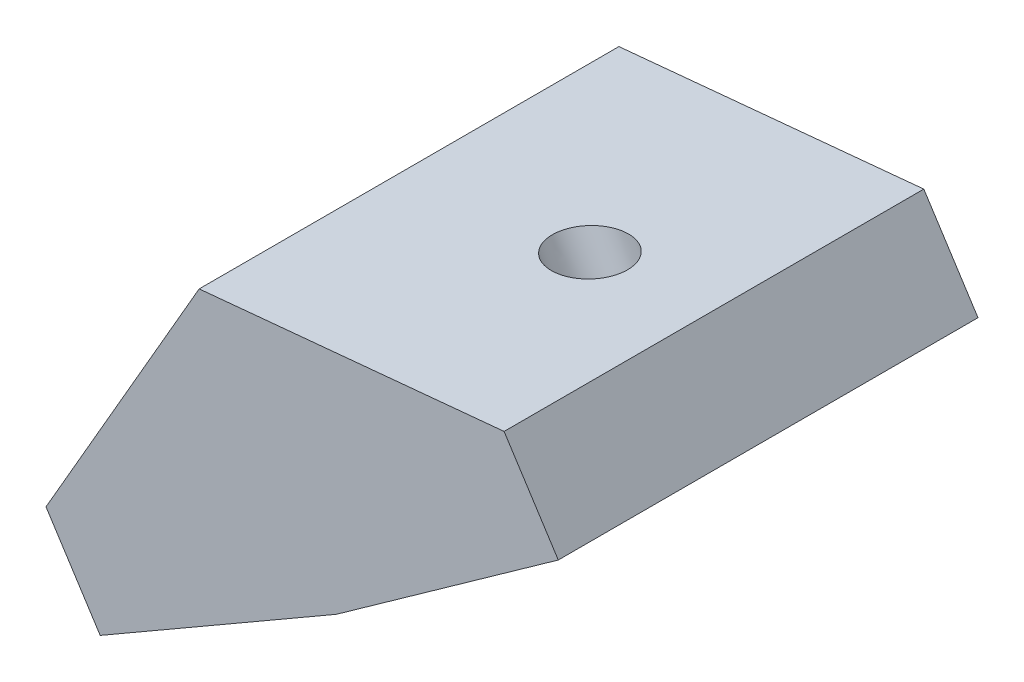
ISO-10303-21;
HEADER;
FILE_DESCRIPTION(('STEP AP214'),'2;1');
FILE_NAME('part.step','',(''),(''),'','','');
FILE_SCHEMA(('AUTOMOTIVE_DESIGN { 1 0 10303 214 1 1 1 1 }'));
ENDSEC;
DATA;
#1=APPLICATION_CONTEXT('core data for automotive mechanical design processes');
#2=APPLICATION_PROTOCOL_DEFINITION('international standard','automotive_design',2000,#1);
#3=PRODUCT_CONTEXT('',#1,'mechanical');
#4=PRODUCT('Part','Part','',(#3));
#5=PRODUCT_RELATED_PRODUCT_CATEGORY('part','',(#4));
#6=PRODUCT_DEFINITION_FORMATION('','',#4);
#7=PRODUCT_DEFINITION_CONTEXT('part definition',#1,'design');
#8=PRODUCT_DEFINITION('design','',#6,#7);
#9=PRODUCT_DEFINITION_SHAPE('','',#8);
#10=(LENGTH_UNIT() NAMED_UNIT(*) SI_UNIT(.MILLI.,.METRE.));
#11=(NAMED_UNIT(*) PLANE_ANGLE_UNIT() SI_UNIT($,.RADIAN.));
#12=(NAMED_UNIT(*) SI_UNIT($,.STERADIAN.) SOLID_ANGLE_UNIT());
#13=UNCERTAINTY_MEASURE_WITH_UNIT(LENGTH_MEASURE(1.E-05),#10,'distance_accuracy_value','');
#14=(GEOMETRIC_REPRESENTATION_CONTEXT(3) GLOBAL_UNCERTAINTY_ASSIGNED_CONTEXT((#13)) GLOBAL_UNIT_ASSIGNED_CONTEXT((#10,
#11,#12)) REPRESENTATION_CONTEXT('',''));
#15=CARTESIAN_POINT('',(0.,0.,0.));
#16=DIRECTION('',(0.,0.,1.));
#17=DIRECTION('',(1.,0.,0.));
#18=AXIS2_PLACEMENT_3D('',#15,#16,#17);
#19=CARTESIAN_POINT('',(1.98354597778799,3.18342045954603,7.5));
#20=DIRECTION('',(-0.5,0.866025403784439,0.));
#21=DIRECTION('',(-0.866025403784439,-0.5,0.));
#22=AXIS2_PLACEMENT_3D('',#19,#20,#21);
#23=PLANE('',#22);
#24=DIRECTION('',(0.866025403784439,0.5,0.));
#25=VECTOR('',#24,1.);
#26=CARTESIAN_POINT('',(1.98354597778799,3.18342045954603,-7.5));
#27=LINE('',#26,#25);
#28=CARTESIAN_POINT('',(1.98354597778799,3.18342045954603,-7.5));
#29=VERTEX_POINT('',#28);
#30=CARTESIAN_POINT('',(10.4192557731961,8.05377978073045,-7.5));
#31=VERTEX_POINT('',#30);
#32=EDGE_CURVE('E153',#29,#31,#27,.T.);
#33=ORIENTED_EDGE('',*,*,#32,.T.);
#34=DIRECTION('',(0.,0.,-1.));
#35=VECTOR('',#34,1.);
#36=CARTESIAN_POINT('',(10.4192557731961,8.05377978073045,7.5));
#37=LINE('',#36,#35);
#38=CARTESIAN_POINT('',(10.4192557731961,8.05377978073046,7.5));
#39=VERTEX_POINT('',#38);
#40=EDGE_CURVE('E123',#39,#31,#37,.T.);
#41=ORIENTED_EDGE('',*,*,#40,.F.);
#42=DIRECTION('',(0.866025403784439,0.5,0.));
#43=VECTOR('',#42,1.);
#44=CARTESIAN_POINT('',(1.98354597778799,3.18342045954603,7.5));
#45=LINE('',#44,#43);
#46=CARTESIAN_POINT('',(1.98354597778799,3.18342045954603,7.5));
#47=VERTEX_POINT('',#46);
#48=EDGE_CURVE('E86',#47,#39,#45,.T.);
#49=ORIENTED_EDGE('',*,*,#48,.F.);
#50=DIRECTION('',(0.,0.,-1.));
#51=VECTOR('',#50,1.);
#52=CARTESIAN_POINT('',(1.98354597778799,3.18342045954603,7.5));
#53=LINE('',#52,#51);
#54=EDGE_CURVE('E11',#47,#29,#53,.T.);
#55=ORIENTED_EDGE('',*,*,#54,.T.);
#56=EDGE_LOOP('',(#33,#41,#49,#55));
#57=FACE_BOUND('',#56,.T.);
#58=CARTESIAN_POINT('',(6.8662474309727,6.0024494579148,0.));
#59=CARTESIAN_POINT('',(6.86624450170067,6.0024477666988,0.0692360372808675));
#60=CARTESIAN_POINT('',(6.86124738041633,5.99956267738011,0.138544759383818));
#61=CARTESIAN_POINT('',(6.84138977339541,5.98809788262112,0.275212471246358));
#62=CARTESIAN_POINT('',(6.82652928765163,5.97951817717667,0.342571461004522));
#63=CARTESIAN_POINT('',(6.78735825768453,5.95690277248074,0.473531004420582));
#64=CARTESIAN_POINT('',(6.76304771528751,5.94286707428367,0.537131558804822));
#65=CARTESIAN_POINT('',(6.70564617673228,5.9097262805469,0.658806862274286));
#66=CARTESIAN_POINT('',(6.67255518338912,5.89062118663247,0.716881613131101));
#67=CARTESIAN_POINT('',(6.59850569104199,5.84786869229251,0.825907059313234));
#68=CARTESIAN_POINT('',(6.55754719495367,5.82422129355034,0.876857757278686));
#69=CARTESIAN_POINT('',(6.46889232818168,5.77303638235455,0.970228867189419));
#70=CARTESIAN_POINT('',(6.42119596005827,5.74549887137912,1.01264928237605));
#71=CARTESIAN_POINT('',(6.32038090105841,5.68729326992718,1.08779007522111));
#72=CARTESIAN_POINT('',(6.26726221206751,5.65662518053929,1.1205104562526));
#73=CARTESIAN_POINT('',(6.1570675922227,5.59300428710865,1.1753486492635));
#74=CARTESIAN_POINT('',(6.09999166246649,5.56005148369965,1.19746646418396));
#75=CARTESIAN_POINT('',(5.98345679052688,5.49277004401534,1.23048951180262));
#76=CARTESIAN_POINT('',(5.92399784876444,5.45844140798305,1.24139474648157));
#77=CARTESIAN_POINT('',(5.80433690463181,5.38935512967659,1.25169185277391));
#78=CARTESIAN_POINT('',(5.74413490230365,5.35459748742666,1.2510837250385));
#79=CARTESIAN_POINT('',(5.62464828690112,5.28561185785946,1.2383708824736));
#80=CARTESIAN_POINT('',(5.56536367382643,5.251383870542,1.22626616764803));
#81=CARTESIAN_POINT('',(5.44934698670544,5.18440160500221,1.19089401654125));
#82=CARTESIAN_POINT('',(5.39261491265609,5.15164732677813,1.1676265802733));
#83=CARTESIAN_POINT('',(5.28326804968944,5.08851588600928,1.11057073629286));
#84=CARTESIAN_POINT('',(5.23065326076428,5.05813872345997,1.07678232860041));
#85=CARTESIAN_POINT('',(5.13099215221383,5.00059935561063,0.9996164743412));
#86=CARTESIAN_POINT('',(5.0839458325751,4.97343715030284,0.956239027797567));
#87=CARTESIAN_POINT('',(4.99671925925276,4.92307686471471,0.861091506091968));
#88=CARTESIAN_POINT('',(4.95653900555091,4.89987878442385,0.809321430952286));
#89=CARTESIAN_POINT('',(4.88415278426738,4.85808658008017,0.698816540403866));
#90=CARTESIAN_POINT('',(4.85194681666491,4.83949245601536,0.640081725013289));
#91=CARTESIAN_POINT('',(4.7963974458961,4.80742101184867,0.517267336754032));
#92=CARTESIAN_POINT('',(4.77305404270962,4.79394369173516,0.453187763897507));
#93=CARTESIAN_POINT('',(4.73587363833596,4.77247757526146,0.321451256574587));
#94=CARTESIAN_POINT('',(4.72203663713271,4.76448877889198,0.253794322114244));
#95=CARTESIAN_POINT('',(4.70425067656512,4.75422004977049,0.116769153873382));
#96=CARTESIAN_POINT('',(4.70030171719166,4.7519401170132,0.0474009200944441));
#97=CARTESIAN_POINT('',(4.70240075690233,4.75315199815519,-0.0911335856281336));
#98=CARTESIAN_POINT('',(4.70844875598592,4.75664381205416,-0.160299857571784));
#99=CARTESIAN_POINT('',(4.73037490213922,4.76930287843806,-0.296522748723949));
#100=CARTESIAN_POINT('',(4.74625304921701,4.77847013092765,-0.363579367930733));
#101=CARTESIAN_POINT('',(4.78740155435995,4.80222723144869,-0.493733448479131));
#102=CARTESIAN_POINT('',(4.81267191244018,4.81681707948884,-0.556830909814389));
#103=CARTESIAN_POINT('',(4.87190785423696,4.8510169664309,-0.677326366223164));
#104=CARTESIAN_POINT('',(4.90587343797276,4.87062700534394,-0.734724361284056));
#105=CARTESIAN_POINT('',(4.9815630202021,4.9143264060189,-0.84223777313564));
#106=CARTESIAN_POINT('',(5.02328701871567,4.93841576779238,-0.892353189907531));
#107=CARTESIAN_POINT('',(5.11334263160538,4.9904094001363,-0.983919194089535));
#108=CARTESIAN_POINT('',(5.16167424599913,5.01831367071691,-1.02536978147655));
#109=CARTESIAN_POINT('',(5.2636120435357,5.07716748556524,-1.09846286172483));
#110=CARTESIAN_POINT('',(5.31721822669149,5.10811702984046,-1.13010535456198));
#111=CARTESIAN_POINT('',(5.42822663324675,5.17220776324743,-1.18270950027551));
#112=CARTESIAN_POINT('',(5.48562885665374,5.20534895238353,-1.20367115313074));
#113=CARTESIAN_POINT('',(5.60264611371615,5.27290889724835,-1.2343354656682));
#114=CARTESIAN_POINT('',(5.66226114737442,5.30732765297873,-1.24403812533595));
#115=CARTESIAN_POINT('',(5.78205976147147,5.37649341507621,-1.25191683784366));
#116=CARTESIAN_POINT('',(5.84224334191051,5.41124042144347,-1.25009289067842));
#117=CARTESIAN_POINT('',(5.96151910480447,5.48010431525809,-1.23496869615716));
#118=CARTESIAN_POINT('',(6.02061128725987,5.51422120270572,-1.22166844880612));
#119=CARTESIAN_POINT('',(6.13607441110728,5.58088386834051,-1.1839584964282));
#120=CARTESIAN_POINT('',(6.19244535250276,5.61342964652967,-1.15954879141544));
#121=CARTESIAN_POINT('',(6.30091121209113,5.6760524397609,-1.10029317158898));
#122=CARTESIAN_POINT('',(6.35300613029244,5.70612945480783,-1.06544725679583));
#123=CARTESIAN_POINT('',(6.45148308602903,5.76298515171131,-0.986280345090121));
#124=CARTESIAN_POINT('',(6.4978651235783,5.78976383357594,-0.941959348200784));
#125=CARTESIAN_POINT('',(6.58363708886985,5.83928430082594,-0.845064603531294));
#126=CARTESIAN_POINT('',(6.62302701663075,5.86202608622207,-0.792490855773126));
#127=CARTESIAN_POINT('',(6.69372817044642,5.90284541640955,-0.680541049183821));
#128=CARTESIAN_POINT('',(6.72503939652207,5.92092296121298,-0.621164990370271));
#129=CARTESIAN_POINT('',(6.77872018148761,5.95191557686314,-0.497246792454204));
#130=CARTESIAN_POINT('',(6.80108974039739,5.96483064772136,-0.432704653363173));
#131=CARTESIAN_POINT('',(6.83424606031273,5.98397345794983,-0.307852941350757));
#132=CARTESIAN_POINT('',(6.84606865543584,5.99079923642669,-0.247909616095609));
#133=CARTESIAN_POINT('',(6.85807954031633,5.99773372404564,-0.156424213290056));
#134=CARTESIAN_POINT('',(6.86113002738977,5.99949492357865,-0.125353522952124));
#135=CARTESIAN_POINT('',(6.86522039572928,6.00185649884054,-0.0628608789359379));
#136=CARTESIAN_POINT('',(6.86624876106408,6.00245022584342,-0.031437932494741));
#137=CARTESIAN_POINT('',(6.8662474309727,6.0024494579148,0.));
#138=B_SPLINE_CURVE_WITH_KNOTS('',3,(#58,#59,#60,#61,#62,#63,#64,#65,#66,#67,#68,#69,#70,#71,
#72,#73,#74,#75,#76,#77,#78,#79,#80,#81,#82,#83,#84,#85,#86,#87,#88,#89,#90,#91,#92,#93,#94,#95,
#96,#97,#98,#99,#100,#101,#102,#103,#104,#105,#106,#107,#108,#109,#110,#111,#112,#113,#114,#115,
#116,#117,#118,#119,#120,#121,#122,#123,#124,#125,#126,#127,#128,#129,#130,#131,#132,#133,#134,
#135,#136,#137),.UNSPECIFIED.,.T.,.F.,(4,2,2,2,2,2,2,2,2,2,2,2,2,2,2,2,2,2,2,2,2,2,2,2,2,2,2,2,
2,2,2,2,2,2,2,2,2,2,2,4),(0.,0.207595574075841,0.415191148303471,0.622786682411624,
0.830382149963753,1.03797754058197,1.24557285231763,1.45316809186484,1.66076327382698,
1.8683584191167,2.07595355266464,2.28354868614155,2.49114381937174,2.69873895220653,
2.90633408454058,3.1139292163234,3.32152434756493,3.52911947833437,3.73671460875266,
3.94430973897923,4.15190486919449,4.35949999958012,4.56709513029909,4.7746902614779,
4.98228539319263,5.18988052546066,5.39747565823873,5.60507079142771,5.81266592488346,
6.02026105843259,6.2278561918915,6.43545132508646,6.64304645787265,6.85064159015006,
7.05823672187442,7.26583185306203,7.47342698378804,7.65715996579783,7.75089039943373,
7.84515309701597),.UNSPECIFIED.);
#139=CARTESIAN_POINT('',(6.8662474309727,6.0024494579148,0.));
#140=VERTEX_POINT('',#139);
#141=EDGE_CURVE('E162',#140,#140,#138,.T.);
#142=ORIENTED_EDGE('',*,*,#141,.F.);
#143=EDGE_LOOP('',(#142));
#144=FACE_BOUND('',#143,.T.);
#145=ADVANCED_FACE('F38',(#57,#144),#23,.F.);
#146=CARTESIAN_POINT('',(5.52101325506801,15.6773344329994,7.5));
#147=DIRECTION('',(0.866025403784439,-0.5,0.));
#148=DIRECTION('',(0.5,0.866025403784439,0.));
#149=AXIS2_PLACEMENT_3D('',#146,#147,#148);
#150=PLANE('',#149);
#151=DIRECTION('',(-0.5,-0.866025403784439,0.));
#152=VECTOR('',#151,1.);
#153=CARTESIAN_POINT('',(5.52101325506801,15.6773344329994,-7.5));
#154=LINE('',#153,#152);
#155=CARTESIAN_POINT('',(5.52101325506801,15.6773344329994,-7.5));
#156=VERTEX_POINT('',#155);
#157=CARTESIAN_POINT('',(0.0473877982673191,6.19673704021823,-7.5));
#158=VERTEX_POINT('',#157);
#159=EDGE_CURVE('E79',#156,#158,#154,.T.);
#160=ORIENTED_EDGE('',*,*,#159,.T.);
#161=DIRECTION('',(0.,0.,-1.));
#162=VECTOR('',#161,1.);
#163=CARTESIAN_POINT('',(0.0473877982673191,6.19673704021823,7.5));
#164=LINE('',#163,#162);
#165=CARTESIAN_POINT('',(0.0473877982673191,6.19673704021823,7.5));
#166=VERTEX_POINT('',#165);
#167=EDGE_CURVE('E53',#166,#158,#164,.T.);
#168=ORIENTED_EDGE('',*,*,#167,.F.);
#169=DIRECTION('',(-0.5,-0.866025403784439,0.));
#170=VECTOR('',#169,1.);
#171=CARTESIAN_POINT('',(5.52101325506801,15.6773344329994,7.5));
#172=LINE('',#171,#170);
#173=CARTESIAN_POINT('',(5.52101325506801,15.6773344329994,7.5));
#174=VERTEX_POINT('',#173);
#175=EDGE_CURVE('E62',#174,#166,#172,.T.);
#176=ORIENTED_EDGE('',*,*,#175,.F.);
#177=DIRECTION('',(0.,0.,-1.));
#178=VECTOR('',#177,1.);
#179=CARTESIAN_POINT('',(5.52101325506801,15.6773344329994,7.5));
#180=LINE('',#179,#178);
#181=EDGE_CURVE('E76',#174,#156,#180,.T.);
#182=ORIENTED_EDGE('',*,*,#181,.T.);
#183=EDGE_LOOP('',(#160,#168,#176,#182));
#184=FACE_BOUND('',#183,.T.);
#185=CARTESIAN_POINT('',(2.94887457767793,11.2222595596468,0.));
#186=CARTESIAN_POINT('',(2.94887584733604,11.2222617587591,-0.0326197951711391));
#187=CARTESIAN_POINT('',(2.9481868518324,11.2210683835406,-0.0652248467351395));
#188=CARTESIAN_POINT('',(2.94408360819247,11.2139613570805,-0.162058538444198));
#189=CARTESIAN_POINT('',(2.93866183101234,11.2045705635374,-0.225999737290917));
#190=CARTESIAN_POINT('',(2.92252695436781,11.1766241374148,-0.352027765052248));
#191=CARTESIAN_POINT('',(2.91174279221233,11.1579454206438,-0.414077475623657));
#192=CARTESIAN_POINT('',(2.88525167828459,11.1120614653735,-0.533848543786173));
#193=CARTESIAN_POINT('',(2.8695444914653,11.0848558197608,-0.591569694549542));
#194=CARTESIAN_POINT('',(2.84258431082557,11.0381594171102,-0.674260969297377));
#195=CARTESIAN_POINT('',(2.83293732818723,11.0214503530396,-0.701382589636438));
#196=CARTESIAN_POINT('',(2.81260213580987,10.9862287666594,-0.754005070432247));
#197=CARTESIAN_POINT('',(2.80191423043182,10.9677167715184,-0.779506401072024));
#198=CARTESIAN_POINT('',(2.76815511604019,10.9092442701741,-0.853942994372768));
#199=CARTESIAN_POINT('',(2.74358607562373,10.8666894438793,-0.90020850367893));
#200=CARTESIAN_POINT('',(2.69121304602316,10.7759766956647,-0.98475738049099));
#201=CARTESIAN_POINT('',(2.66340676749011,10.7278148084761,-1.02303504497878));
#202=CARTESIAN_POINT('',(2.61853040323954,10.6500866655352,-1.07552757719033));
#203=CARTESIAN_POINT('',(2.60232694240654,10.6220214481139,-1.09277028002151));
#204=CARTESIAN_POINT('',(2.56930621028826,10.5648278623819,-1.12462776713494));
#205=CARTESIAN_POINT('',(2.55248952497829,10.5357005090102,-1.13924498497161));
#206=CARTESIAN_POINT('',(2.50125794674301,10.4469648125548,-1.17909685755505));
#207=CARTESIAN_POINT('',(2.4660460557191,10.3859760282707,-1.20034970351963));
#208=CARTESIAN_POINT('',(2.39444055417387,10.2619516614929,-1.23188905925857));
#209=CARTESIAN_POINT('',(2.35804706637386,10.1989162915587,-1.24217670415429));
#210=CARTESIAN_POINT('',(2.28489886714418,10.0722198940107,-1.25168770432415));
#211=CARTESIAN_POINT('',(2.24814416976061,10.0085588907255,-1.25091148814301));
#212=CARTESIAN_POINT('',(2.17511056018024,9.88206096827221,-1.23829949671314));
#213=CARTESIAN_POINT('',(2.13883166048334,9.81922407075445,-1.22646343149415));
#214=CARTESIAN_POINT('',(2.06759068578763,9.69583108300075,-1.19187059687837));
#215=CARTESIAN_POINT('',(2.03262873103718,9.63527520104104,-1.1691128328313));
#216=CARTESIAN_POINT('',(1.96489189963815,9.51795156751418,-1.11297111348739));
#217=CARTESIAN_POINT('',(1.93211736289614,9.46118440468247,-1.07958551134187));
#218=CARTESIAN_POINT('',(1.86965967346187,9.35300451325892,-1.0026955165349));
#219=CARTESIAN_POINT('',(1.83997718706259,9.30159293872038,-0.959188949452442));
#220=CARTESIAN_POINT('',(1.78538019092549,9.20702816747027,-0.864150894334477));
#221=CARTESIAN_POINT('',(1.76036001060682,9.1636919439438,-0.812863148982555));
#222=CARTESIAN_POINT('',(1.71580969465246,9.08652853321759,-0.704563525624899));
#223=CARTESIAN_POINT('',(1.6961146544308,9.05241572289656,-0.647823392491848));
#224=CARTESIAN_POINT('',(1.66229875911655,8.99384487410882,-0.530309070940124));
#225=CARTESIAN_POINT('',(1.64802519375586,8.96912233369894,-0.469712455148663));
#226=CARTESIAN_POINT('',(1.63071793870586,8.93914528861288,-0.376659804918452));
#227=CARTESIAN_POINT('',(1.62566858831768,8.9303995571954,-0.34565493225922));
#228=CARTESIAN_POINT('',(1.61686800803186,8.91515650500429,-0.282883860507136));
#229=CARTESIAN_POINT('',(1.61311803789382,8.90866136619829,-0.251116954335057));
#230=CARTESIAN_POINT('',(1.60388362077754,8.89266688657454,-0.154977345592477));
#231=CARTESIAN_POINT('',(1.60041780689783,8.88666392084539,-0.0897825992668911));
#232=CARTESIAN_POINT('',(1.59903773053306,8.88427355846332,0.0408286664411757));
#233=CARTESIAN_POINT('',(1.60112222282497,8.88788400502088,0.10624513279164));
#234=CARTESIAN_POINT('',(1.60829292987546,8.90030403395852,0.202607632172289));
#235=CARTESIAN_POINT('',(1.61132122062271,8.90554918739286,0.234213479646725));
#236=CARTESIAN_POINT('',(1.61866580096376,8.9182703737038,0.296816332316223));
#237=CARTESIAN_POINT('',(1.62298191039589,8.92574609453124,0.327813422028465));
#238=CARTESIAN_POINT('',(1.63793609087852,8.95164749491282,0.420374510947448));
#239=CARTESIAN_POINT('',(1.65052100986196,8.97344521400159,0.480722209451535));
#240=CARTESIAN_POINT('',(1.6803813368739,9.02516481751615,0.596588851527746));
#241=CARTESIAN_POINT('',(1.6976588081518,9.05509027559473,0.652105656812775));
#242=CARTESIAN_POINT('',(1.72693657802097,9.10580086054105,0.731610227286935));
#243=CARTESIAN_POINT('',(1.7374420425097,9.12399685879323,0.757849731553722));
#244=CARTESIAN_POINT('',(1.75945314685944,9.16212120985813,0.808577603695162));
#245=CARTESIAN_POINT('',(1.77095845474992,9.182048987681,0.833066547910563));
#246=CARTESIAN_POINT('',(1.80711926555941,9.24468134924568,0.904262185547052));
#247=CARTESIAN_POINT('',(1.833204088488,9.28986158786458,0.94811572216587));
#248=CARTESIAN_POINT('',(1.88840075353818,9.38546501613992,1.02743380437182));
#249=CARTESIAN_POINT('',(1.91751473487229,9.43589191102115,1.06289236268519));
#250=CARTESIAN_POINT('',(1.9642824212512,9.51689591998188,1.11081496435876));
#251=CARTESIAN_POINT('',(1.98115027127592,9.54611189323915,1.12641732626972));
#252=CARTESIAN_POINT('',(2.01543360291231,9.60549236548614,1.15488942430516));
#253=CARTESIAN_POINT('',(2.03284856246093,9.63565596023611,1.16776167976242));
#254=CARTESIAN_POINT('',(2.08577330956811,9.72732431120346,1.20223087432395));
#255=CARTESIAN_POINT('',(2.12197876020466,9.79003399121689,1.21969630928818));
#256=CARTESIAN_POINT('',(2.19527651150235,9.91698942054501,1.24332303649817));
#257=CARTESIAN_POINT('',(2.23236873870772,9.98123504263061,1.2494852617764));
#258=CARTESIAN_POINT('',(2.30659394064148,10.109796863582,1.25045263655064));
#259=CARTESIAN_POINT('',(2.3437269147801,10.1741130614262,1.24525794831646));
#260=CARTESIAN_POINT('',(2.41716257336773,10.3013073531872,1.22356743920149));
#261=CARTESIAN_POINT('',(2.4534652128586,10.3641853692343,1.20707100788205));
#262=CARTESIAN_POINT('',(2.52435710525414,10.4869737287081,1.162982008808));
#263=CARTESIAN_POINT('',(2.55894614851481,10.5468837090208,1.13538808711612));
#264=CARTESIAN_POINT('',(2.62549280733007,10.6621459031627,1.06949272930719));
#265=CARTESIAN_POINT('',(2.65744992658971,10.717497257384,1.03118927968017));
#266=CARTESIAN_POINT('',(2.71723569268809,10.8210492418359,0.945301979798589));
#267=CARTESIAN_POINT('',(2.74512739755328,10.8693590917722,0.897894378210401));
#268=CARTESIAN_POINT('',(2.79556330726423,10.9567166499175,0.796271234998531));
#269=CARTESIAN_POINT('',(2.81826821761349,10.9960427082237,0.74237574309615));
#270=CARTESIAN_POINT('',(2.85813196549086,11.0650887449274,0.629640863912478));
#271=CARTESIAN_POINT('',(2.87545282461914,11.0950893529683,0.571031231821137));
#272=CARTESIAN_POINT('',(2.90451965739985,11.1454345841596,0.450483635084461));
#273=CARTESIAN_POINT('',(2.91640625193808,11.1660227698288,0.388682105552025));
#274=CARTESIAN_POINT('',(2.93330462070941,11.1952916031057,0.272553140735319));
#275=CARTESIAN_POINT('',(2.93913135292311,11.2053837993419,0.218693753724129));
#276=CARTESIAN_POINT('',(2.94691388430426,11.2188635391055,0.109875107547908));
#277=CARTESIAN_POINT('',(2.94887244016045,11.2222558573579,0.0549166598733436));
#278=CARTESIAN_POINT('',(2.94887457767793,11.2222595596468,0.));
#279=B_SPLINE_CURVE_WITH_KNOTS('',3,(#185,#186,#187,#188,#189,#190,#191,#192,#193,#194,#195,
#196,#197,#198,#199,#200,#201,#202,#203,#204,#205,#206,#207,#208,#209,#210,#211,#212,#213,#214,
#215,#216,#217,#218,#219,#220,#221,#222,#223,#224,#225,#226,#227,#228,#229,#230,#231,#232,#233,
#234,#235,#236,#237,#238,#239,#240,#241,#242,#243,#244,#245,#246,#247,#248,#249,#250,#251,#252,
#253,#254,#255,#256,#257,#258,#259,#260,#261,#262,#263,#264,#265,#266,#267,#268,#269,#270,#271,
#272,#273,#274,#275,#276,#277,#278),.UNSPECIFIED.,.T.,.F.,(4,2,2,2,2,2,2,2,2,2,2,2,2,2,2,2,2,2,
2,2,2,2,2,2,2,2,2,2,2,2,2,2,2,2,2,2,2,2,2,2,2,2,2,2,2,2,4),(0.,0.0978185653692396,
0.291392142481428,0.487602215990524,0.683821658865948,0.783584483686755,0.883318225399564,
1.08492246533855,1.28667015428753,1.39669196638651,1.5066112673275,1.72634367673541,
1.94605333715902,2.16575448742887,2.38546139804733,2.60518832139714,2.82494930936829,
3.04475755517993,3.25872961251098,3.46501669872181,3.66496390990001,3.76269107227093,
3.86051271853818,4.05620926468589,4.2518619095961,4.348309711366,4.44474402672179,
4.63996811580244,4.83527818152613,4.93603029663326,5.03674908664931,5.240335093794,
5.44406586341136,5.55546687694603,5.66676463837759,5.88925501479194,6.1117270247337,
6.3341958559726,6.55667670432075,6.77918470444173,7.0017345666965,7.22034560004287,
7.43079914879556,7.63411294065445,7.83181754383385,7.9966162888608,8.16129754622312),.UNSPECIFIED.);
#280=CARTESIAN_POINT('',(2.94887457767793,11.2222595596468,0.));
#281=VERTEX_POINT('',#280);
#282=EDGE_CURVE('E42',#281,#281,#279,.T.);
#283=ORIENTED_EDGE('',*,*,#282,.F.);
#284=EDGE_LOOP('',(#283));
#285=FACE_BOUND('',#284,.T.);
#286=ADVANCED_FACE('F182',(#184,#285),#150,.F.);
#287=CARTESIAN_POINT('',(18.354984249456,13.7023028815834,7.5));
#288=DIRECTION('',(-0.579887717553381,0.814696406663691,0.));
#289=DIRECTION('',(0.814696406663691,0.579887717553381,0.));
#290=AXIS2_PLACEMENT_3D('',#287,#288,#289);
#291=PLANE('',#290);
#292=DIRECTION('',(-0.814696406663691,-0.579887717553381,0.));
#293=VECTOR('',#292,1.);
#294=CARTESIAN_POINT('',(18.354984249456,13.7023028815834,-7.5));
#295=LINE('',#294,#293);
#296=CARTESIAN_POINT('',(18.354984249456,13.7023028815834,-7.5));
#297=VERTEX_POINT('',#296);
#298=EDGE_CURVE('E118',#297,#31,#295,.T.);
#299=ORIENTED_EDGE('',*,*,#298,.F.);
#300=DIRECTION('',(0.,0.,-1.));
#301=VECTOR('',#300,1.);
#302=CARTESIAN_POINT('',(18.354984249456,13.7023028815834,7.5));
#303=LINE('',#302,#301);
#304=CARTESIAN_POINT('',(18.354984249456,13.7023028815834,7.5));
#305=VERTEX_POINT('',#304);
#306=EDGE_CURVE('E114',#305,#297,#303,.T.);
#307=ORIENTED_EDGE('',*,*,#306,.F.);
#308=DIRECTION('',(-0.814696406663691,-0.579887717553381,0.));
#309=VECTOR('',#308,1.);
#310=CARTESIAN_POINT('',(18.354984249456,13.7023028815834,7.5));
#311=LINE('',#310,#309);
#312=EDGE_CURVE('E103',#305,#39,#311,.T.);
#313=ORIENTED_EDGE('',*,*,#312,.T.);
#314=ORIENTED_EDGE('',*,*,#40,.T.);
#315=EDGE_LOOP('',(#299,#307,#313,#314));
#316=FACE_BOUND('',#315,.T.);
#317=CARTESIAN_POINT('',(15.7990290843421,11.883015359577,0.));
#318=CARTESIAN_POINT('',(15.7990263287162,11.8830133981671,0.0692360899975053));
#319=CARTESIAN_POINT('',(15.7943253825869,11.8796673407905,0.138544863359553));
#320=CARTESIAN_POINT('',(15.7756447183679,11.8663707463195,0.275212678011069));
#321=CARTESIAN_POINT('',(15.7616650002625,11.856420209214,0.342571719297281));
#322=CARTESIAN_POINT('',(15.7248156040959,11.8301914053781,0.473531346869848));
#323=CARTESIAN_POINT('',(15.7019459299595,11.8139131414411,0.537131934815486));
#324=CARTESIAN_POINT('',(15.6479465472664,11.7754772547438,0.658807277255461));
#325=CARTESIAN_POINT('',(15.6168168447593,11.7533196362896,0.716882035796894));
#326=CARTESIAN_POINT('',(15.5471562520051,11.7037363537254,0.825907469706494));
#327=CARTESIAN_POINT('',(15.5086253680238,11.6763106940754,0.876858151105891));
#328=CARTESIAN_POINT('',(15.4252250975089,11.6169477312383,0.970229206790145));
#329=CARTESIAN_POINT('',(15.3803557164774,11.5850104319676,1.01264958847967));
#330=CARTESIAN_POINT('',(15.2855160345818,11.5175050812405,1.08779030409413));
#331=CARTESIAN_POINT('',(15.2355457377699,11.4819370326684,1.12051064572459));
#332=CARTESIAN_POINT('',(15.1318824686037,11.4081511953194,1.17534876225122));
#333=CARTESIAN_POINT('',(15.0781894986085,11.3699334082217,1.19746654386603));
#334=CARTESIAN_POINT('',(14.9685618017966,11.2919021878003,1.23048953839764));
#335=CARTESIAN_POINT('',(14.9126270758847,11.2520887551207,1.2413947558393));
#336=CARTESIAN_POINT('',(14.8000586092866,11.1719643423577,1.25169184835543));
#337=CARTESIAN_POINT('',(14.7434248686908,11.1316533623386,1.25108372491754));
#338=CARTESIAN_POINT('',(14.6310204013803,11.0516456816145,1.23837091368053));
#339=CARTESIAN_POINT('',(14.5752496746649,11.0119489809088,1.2262662258904));
#340=CARTESIAN_POINT('',(14.466109466735,10.9342647471843,1.19089415278591));
#341=CARTESIAN_POINT('',(14.412739985514,10.8962772141608,1.16762676750186));
#342=CARTESIAN_POINT('',(14.3098742680118,10.823059061179,1.11057105112864));
#343=CARTESIAN_POINT('',(14.2603780317138,10.7878284412088,1.07678272008526));
#344=CARTESIAN_POINT('',(14.1666239706695,10.7210958178344,0.999617045760111));
#345=CARTESIAN_POINT('',(14.1223661458943,10.6895938144097,0.956239702531191));
#346=CARTESIAN_POINT('',(14.040309588633,10.6311872849205,0.861092412989339));
#347=CARTESIAN_POINT('',(14.0025108561076,10.604282758828,0.809322466727316));
#348=CARTESIAN_POINT('',(13.9344150112555,10.5558132384973,0.698817855101724));
#349=CARTESIAN_POINT('',(13.9041178988839,10.5342482442272,0.640083189779642));
#350=CARTESIAN_POINT('',(13.851860916929,10.497052570177,0.51726911459081));
#351=CARTESIAN_POINT('',(13.8299010473024,10.4814218903662,0.453189704751824));
#352=CARTESIAN_POINT('',(13.7949242226903,10.4565259526578,0.321453524477031));
#353=CARTESIAN_POINT('',(13.7819072676703,10.4472606947356,0.253796754055046));
#354=CARTESIAN_POINT('',(13.765175290164,10.4353511439301,0.116771900296244));
#355=CARTESIAN_POINT('',(13.7614602676581,10.4327068510327,0.0474038169630384));
#356=CARTESIAN_POINT('',(13.7634346183021,10.4341121618691,-0.0911304171001612));
#357=CARTESIAN_POINT('',(13.769123991451,10.438161765602,-0.16029656783018));
#358=CARTESIAN_POINT('',(13.7897502161129,10.45284317851,-0.296519260456452));
#359=CARTESIAN_POINT('',(13.8046870676433,10.4634749876975,-0.36357580234875));
#360=CARTESIAN_POINT('',(13.8433962787171,10.4910275776859,-0.493729783935393));
#361=CARTESIAN_POINT('',(13.8671686382928,10.5079483585099,-0.556827223615214));
#362=CARTESIAN_POINT('',(13.9228932031965,10.5476122019851,-0.677322699762446));
#363=CARTESIAN_POINT('',(13.9548454085658,10.5703552646657,-0.734720736201017));
#364=CARTESIAN_POINT('',(14.0260483928405,10.6210363965527,-0.842234296120081));
#365=CARTESIAN_POINT('',(14.0652991717889,10.6489744657898,-0.892349819557627));
#366=CARTESIAN_POINT('',(14.1500167255747,10.7092750495407,-0.983916099654518));
#367=CARTESIAN_POINT('',(14.1954835004499,10.7416375640814,-1.02536685626111));
#368=CARTESIAN_POINT('',(14.2913790202555,10.8098944431455,-1.09846033072586));
#369=CARTESIAN_POINT('',(14.3418077652137,10.8457888076888,-1.13010304852897));
#370=CARTESIAN_POINT('',(14.446236337999,10.9201193757686,-1.18270769051291));
#371=CARTESIAN_POINT('',(14.5002361658423,10.9585555793165,-1.20366961464544));
#372=CARTESIAN_POINT('',(14.6103175185512,11.0369097046636,-1.23433450561472));
#373=CARTESIAN_POINT('',(14.666399043423,11.0768276264671,-1.24403747241841));
#374=CARTESIAN_POINT('',(14.7790969859132,11.1570441980747,-1.25191682497733));
#375=CARTESIAN_POINT('',(14.8357134035322,11.1973428478792,-1.25009321072071));
#376=CARTESIAN_POINT('',(14.9479195738033,11.27720938398,-1.23496969890919));
#377=CARTESIAN_POINT('',(15.0035093264566,11.316777270277,-1.22166980136568));
#378=CARTESIAN_POINT('',(15.1121289260514,11.3940909434139,-1.18396055795423));
#379=CARTESIAN_POINT('',(15.1651587730003,11.431836730259,-1.15955121211856));
#380=CARTESIAN_POINT('',(15.2671959327424,11.5044651292362,-1.10029631327809));
#381=CARTESIAN_POINT('',(15.3162032455537,11.5393477413812,-1.06545076032023));
#382=CARTESIAN_POINT('',(15.4088436444758,11.6052876780801,-0.986284567923438));
#383=CARTESIAN_POINT('',(15.4524767306168,11.6363450026554,-0.941963928537545));
#384=CARTESIAN_POINT('',(15.5331652697608,11.6937777989881,-0.845069886349611));
#385=CARTESIAN_POINT('',(15.5702207228037,11.7201532707739,-0.792496483597797));
#386=CARTESIAN_POINT('',(15.6367318087191,11.7674947853406,-0.680547343220531));
#387=CARTESIAN_POINT('',(15.6661874416365,11.7884608281534,-0.621171605635256));
#388=CARTESIAN_POINT('',(15.7166870706238,11.8244056468014,-0.497254015394472));
#389=CARTESIAN_POINT('',(15.7377310667365,11.8393844226671,-0.432712162765206));
#390=CARTESIAN_POINT('',(15.7689231360281,11.8615864327894,-0.307859569338176));
#391=CARTESIAN_POINT('',(15.7800454791408,11.8695031366176,-0.247915020940399));
#392=CARTESIAN_POINT('',(15.7913449667023,11.8775459289976,-0.156427685786694));
#393=CARTESIAN_POINT('',(15.7942147770989,11.8795886135941,-0.125356314965626));
#394=CARTESIAN_POINT('',(15.7980628787139,11.8823276300476,-0.0628622868116621));
#395=CARTESIAN_POINT('',(15.7990303356132,11.8830162502115,-0.0314386366065741));
#396=CARTESIAN_POINT('',(15.7990290843421,11.883015359577,0.));
#397=B_SPLINE_CURVE_WITH_KNOTS('',3,(#317,#318,#319,#320,#321,#322,#323,#324,#325,#326,#327,
#328,#329,#330,#331,#332,#333,#334,#335,#336,#337,#338,#339,#340,#341,#342,#343,#344,#345,#346,
#347,#348,#349,#350,#351,#352,#353,#354,#355,#356,#357,#358,#359,#360,#361,#362,#363,#364,#365,
#366,#367,#368,#369,#370,#371,#372,#373,#374,#375,#376,#377,#378,#379,#380,#381,#382,#383,#384,
#385,#386,#387,#388,#389,#390,#391,#392,#393,#394,#395,#396),.UNSPECIFIED.,.T.,.F.,(4,2,2,2,2,2,
2,2,2,2,2,2,2,2,2,2,2,2,2,2,2,2,2,2,2,2,2,2,2,2,2,2,2,2,2,2,2,2,2,4),(0.,0.207595729622582,
0.415191459591918,0.622787097911067,0.830382584186746,1.03797789471138,1.24557302503356,
1.45316799044569,1.66076282430838,1.8683575743953,2.07595229765886,2.28354702076017,
2.49114174329785,2.69873646493227,2.90633118542278,3.11392590465408,3.32152062264879,
3.52911533956506,3.73671005567918,3.9443047713553,4.1518994870056,4.35949420304506,
4.56708891984603,4.77468363769745,4.98227835677312,5.18987307711276,5.39746779861757,
5.6050625210611,5.81265724411405,6.02025196738034,6.22784669044054,6.43544141289775,
6.64303613442118,6.85063085478235,7.0582255738801,7.26582029175171,7.4734150085688,
7.65715190431551,7.75088441344268,7.84514922107279),.UNSPECIFIED.);
#398=CARTESIAN_POINT('',(15.7990290843421,11.883015359577,0.));
#399=VERTEX_POINT('',#398);
#400=EDGE_CURVE('E132',#399,#399,#397,.T.);
#401=ORIENTED_EDGE('',*,*,#400,.F.);
#402=EDGE_LOOP('',(#401));
#403=FACE_BOUND('',#402,.T.);
#404=ADVANCED_FACE('F115',(#316,#403),#291,.F.);
#405=CARTESIAN_POINT('',(5.52101325506801,15.6773344329994,7.5));
#406=DIRECTION('',(0.0948492914119581,-0.995491643319345,0.));
#407=DIRECTION('',(-0.995491643319345,-0.0948492914119583,0.));
#408=AXIS2_PLACEMENT_3D('',#405,#406,#407);
#409=PLANE('',#408);
#410=DIRECTION('',(0.995491643319345,0.0948492914119583,0.));
#411=VECTOR('',#410,1.);
#412=CARTESIAN_POINT('',(5.52101325506801,15.6773344329994,-7.5));
#413=LINE('',#412,#411);
#414=CARTESIAN_POINT('',(16.4189100568783,16.7156734250634,-7.5));
#415=VERTEX_POINT('',#414);
#416=EDGE_CURVE('E128',#156,#415,#413,.T.);
#417=ORIENTED_EDGE('',*,*,#416,.F.);
#418=ORIENTED_EDGE('',*,*,#181,.F.);
#419=DIRECTION('',(0.995491643319345,0.0948492914119583,0.));
#420=VECTOR('',#419,1.);
#421=CARTESIAN_POINT('',(5.52101325506801,15.6773344329994,7.5));
#422=LINE('',#421,#420);
#423=CARTESIAN_POINT('',(16.4189100568783,16.7156734250634,7.5));
#424=VERTEX_POINT('',#423);
#425=EDGE_CURVE('E111',#174,#424,#422,.T.);
#426=ORIENTED_EDGE('',*,*,#425,.T.);
#427=DIRECTION('',(0.,0.,-1.));
#428=VECTOR('',#427,1.);
#429=CARTESIAN_POINT('',(16.4189100568783,16.7156734250634,7.5));
#430=LINE('',#429,#428);
#431=EDGE_CURVE('E127',#424,#415,#430,.T.);
#432=ORIENTED_EDGE('',*,*,#431,.T.);
#433=EDGE_LOOP('',(#417,#418,#426,#432));
#434=FACE_BOUND('',#433,.T.);
#435=CARTESIAN_POINT('',(13.3291589334004,16.4212855146597,0.));
#436=CARTESIAN_POINT('',(13.3291614620703,16.4212857555884,-0.0326195200949469));
#437=CARTESIAN_POINT('',(13.3277896900129,16.4211550547348,-0.0652242927426324));
#438=CARTESIAN_POINT('',(13.3196202551366,16.4203766804365,-0.162057000845671));
#439=CARTESIAN_POINT('',(13.3088256832077,16.4193481861186,-0.225997499068142));
#440=CARTESIAN_POINT('',(13.276701731302,16.4162874531674,-0.352024133346082));
#441=CARTESIAN_POINT('',(13.2552308698509,16.4142417343429,-0.414073151805075));
#442=CARTESIAN_POINT('',(13.2024881047655,16.4092164647389,-0.533842903991242));
#443=CARTESIAN_POINT('',(13.1712157327349,16.406236869331,-0.59156343070438));
#444=CARTESIAN_POINT('',(13.1175390722693,16.4011226192577,-0.674253976526536));
#445=CARTESIAN_POINT('',(13.0983322558113,16.3992926160196,-0.701375440117584));
#446=CARTESIAN_POINT('',(13.0578455828979,16.3954350926916,-0.753997631161257));
#447=CARTESIAN_POINT('',(13.0365663324908,16.3934076303451,-0.779498828850283));
#448=CARTESIAN_POINT('',(12.9693531331577,16.3870036345172,-0.85393505018768));
#449=CARTESIAN_POINT('',(12.9204370721234,16.3823429688464,-0.900200371342328));
#450=CARTESIAN_POINT('',(12.8161643289943,16.3724079825854,-0.984749073404027));
#451=CARTESIAN_POINT('',(12.7608030885663,16.3671332276826,-1.02302675098888));
#452=CARTESIAN_POINT('',(12.6714555216578,16.3586202949347,-1.07551977093361));
#453=CARTESIAN_POINT('',(12.6391945847224,16.3555465102082,-1.09276281970645));
#454=CARTESIAN_POINT('',(12.5734506063252,16.3492825000506,-1.12462100811575));
#455=CARTESIAN_POINT('',(12.5399687315348,16.3460923857786,-1.13923858127209));
#456=CARTESIAN_POINT('',(12.4379670851431,16.3363737869857,-1.17909154208202));
#457=CARTESIAN_POINT('',(12.3678604782025,16.3296941106305,-1.20034514422254));
#458=CARTESIAN_POINT('',(12.2252943938995,16.3161105791501,-1.23188610691347));
#459=CARTESIAN_POINT('',(12.152835160922,16.3092067473095,-1.24217460275938));
#460=CARTESIAN_POINT('',(12.0071973816837,16.2953305482914,-1.25168741277707));
#461=CARTESIAN_POINT('',(11.9340188634001,16.2883581837795,-1.25091215559522));
#462=CARTESIAN_POINT('',(11.7886089395171,16.2745036945559,-1.23830217779642));
#463=CARTESIAN_POINT('',(11.7163775587975,16.2676215722147,-1.22646716724364));
#464=CARTESIAN_POINT('',(11.5745363639424,16.2541071073618,-1.19187649760602));
#465=CARTESIAN_POINT('',(11.5049267892112,16.2474747876602,-1.16911984383001));
#466=CARTESIAN_POINT('',(11.3700618389385,16.2346250113155,-1.11298033315977));
#467=CARTESIAN_POINT('',(11.3048071401641,16.228407619154,-1.07959582928021));
#468=CARTESIAN_POINT('',(11.1804524001319,16.2165592434746,-1.0027079289026));
#469=CARTESIAN_POINT('',(11.1213536855452,16.2109283863604,-0.959202357726571));
#470=CARTESIAN_POINT('',(11.0126489604551,16.2005711259885,-0.864165975994842));
#471=CARTESIAN_POINT('',(10.9628325812664,16.1958246790459,-0.812878896588678));
#472=CARTESIAN_POINT('',(10.8741306773295,16.1873732643186,-0.704580609777225));
#473=CARTESIAN_POINT('',(10.834916778978,16.183637009477,-0.647841202292354));
#474=CARTESIAN_POINT('',(10.7675872439077,16.1772219293149,-0.530328370781858));
#475=CARTESIAN_POINT('',(10.7391675135912,16.1745141303086,-0.469732557899945));
#476=CARTESIAN_POINT('',(10.7047071094947,16.171230782897,-0.376681065442413));
#477=CARTESIAN_POINT('',(10.6946533105779,16.1702728685743,-0.345676643218765));
#478=CARTESIAN_POINT('',(10.6771302131529,16.168603288136,-0.282906418932878));
#479=CARTESIAN_POINT('',(10.6696634227773,16.1678918609925,-0.251139909737645));
#480=CARTESIAN_POINT('',(10.6512758657676,16.1661399158457,-0.155001616641048));
#481=CARTESIAN_POINT('',(10.644374089049,16.1654823225493,-0.0898077091079726));
#482=CARTESIAN_POINT('',(10.6416234765232,16.1652202473719,0.0408021275869193));
#483=CARTESIAN_POINT('',(10.6457721612653,16.1656155292517,0.106218003655174));
#484=CARTESIAN_POINT('',(10.6600466312472,16.1669755842277,0.202579784691348));
#485=CARTESIAN_POINT('',(10.6660751408721,16.1675499736463,0.23418540765706));
#486=CARTESIAN_POINT('',(10.6806965311823,16.1689430827896,0.296787874402642));
#487=CARTESIAN_POINT('',(10.689289053148,16.1697617683359,0.327784802696185));
#488=CARTESIAN_POINT('',(10.7190602014995,16.1725983288882,0.420345495273375));
#489=CARTESIAN_POINT('',(10.7441149532753,16.1749855166343,0.480693058067918));
#490=CARTESIAN_POINT('',(10.8035631223702,16.1806496693699,0.596559703178527));
#491=CARTESIAN_POINT('',(10.8379606479771,16.1839270257923,0.652076647118156));
#492=CARTESIAN_POINT('',(10.8962497705836,16.1894807459195,0.731581711382285));
#493=CARTESIAN_POINT('',(10.9171651834172,16.1914735422427,0.757821459843042));
#494=CARTESIAN_POINT('',(10.9609873510543,16.1956488676472,0.808549892227813));
#495=CARTESIAN_POINT('',(10.9838934448264,16.1978313337461,0.833039152538464));
#496=CARTESIAN_POINT('',(11.0558866518047,16.2046907631691,0.904235844335612));
#497=CARTESIAN_POINT('',(11.1078195310823,16.20963886779,0.948090239546084));
#498=CARTESIAN_POINT('',(11.2177121049959,16.2201093050228,1.02741039447951));
#499=CARTESIAN_POINT('',(11.2756760591689,16.2256320434784,1.06287016668508));
#500=CARTESIAN_POINT('',(11.3687879814237,16.2345036396461,1.11079518112367));
#501=CARTESIAN_POINT('',(11.4023713009235,16.2377034194526,1.12639856921799));
#502=CARTESIAN_POINT('',(11.4706283389261,16.2442068710203,1.15487276135319));
#503=CARTESIAN_POINT('',(11.5053010179523,16.2475104437414,1.16774608466346));
#504=CARTESIAN_POINT('',(11.6106727710357,16.2575501423987,1.20221854958858));
#505=CARTESIAN_POINT('',(11.6827570090605,16.2644182451543,1.21968625555399));
#506=CARTESIAN_POINT('',(11.8286915190335,16.2783227163333,1.24331771006181));
#507=CARTESIAN_POINT('',(11.902541644664,16.2853590708158,1.24948239188291));
#508=CARTESIAN_POINT('',(12.0503234066082,16.2994395460243,1.25045485221065));
#509=CARTESIAN_POINT('',(12.1242550417408,16.3064836666378,1.24526279317374));
#510=CARTESIAN_POINT('',(12.2704656655678,16.3204144456252,1.22357767178455));
#511=CARTESIAN_POINT('',(12.3427445647924,16.3273010954745,1.20708399911735));
#512=CARTESIAN_POINT('',(12.483891547155,16.3407494165648,1.16300056842916));
#513=CARTESIAN_POINT('',(12.5527592129675,16.3473110480434,1.13540945651082));
#514=CARTESIAN_POINT('',(12.6852559670947,16.3599351854008,1.0695196547219));
#515=CARTESIAN_POINT('',(12.7488840673635,16.3659975971396,1.03121895125931));
#516=CARTESIAN_POINT('',(12.8679218872383,16.3773393828212,0.945336287265509));
#517=CARTESIAN_POINT('',(12.9234570487678,16.3826307087251,0.897930444907893));
#518=CARTESIAN_POINT('',(13.0238803608129,16.3921989256485,0.796310495693352));
#519=CARTESIAN_POINT('',(13.069088518577,16.3965063065882,0.742416513919847));
#520=CARTESIAN_POINT('',(13.1484625146803,16.404068969055,0.629684415132353));
#521=CARTESIAN_POINT('',(13.1829509886214,16.4073549909288,0.571076114371777));
#522=CARTESIAN_POINT('',(13.2408283175957,16.4128694758357,0.450531009095987));
#523=CARTESIAN_POINT('',(13.26449720433,16.4151246199651,0.388730684025962));
#524=CARTESIAN_POINT('',(13.298149380168,16.4183309603238,0.272595103523596));
#525=CARTESIAN_POINT('',(13.3097540515926,16.4194366399838,0.218727643093831));
#526=CARTESIAN_POINT('',(13.3252539534574,16.4209134526911,0.109892309557664));
#527=CARTESIAN_POINT('',(13.3291546755872,16.4212851089802,0.0549252485459968));
#528=CARTESIAN_POINT('',(13.3291589334004,16.4212855146597,0.));
#529=B_SPLINE_CURVE_WITH_KNOTS('',3,(#435,#436,#437,#438,#439,#440,#441,#442,#443,#444,#445,
#446,#447,#448,#449,#450,#451,#452,#453,#454,#455,#456,#457,#458,#459,#460,#461,#462,#463,#464,
#465,#466,#467,#468,#469,#470,#471,#472,#473,#474,#475,#476,#477,#478,#479,#480,#481,#482,#483,
#484,#485,#486,#487,#488,#489,#490,#491,#492,#493,#494,#495,#496,#497,#498,#499,#500,#501,#502,
#503,#504,#505,#506,#507,#508,#509,#510,#511,#512,#513,#514,#515,#516,#517,#518,#519,#520,#521,
#522,#523,#524,#525,#526,#527,#528),.UNSPECIFIED.,.T.,.F.,(4,2,2,2,2,2,2,2,2,2,2,2,2,2,2,2,2,2,
2,2,2,2,2,2,2,2,2,2,2,2,2,2,2,2,2,2,2,2,2,2,2,2,2,2,2,2,4),(0.,0.0978177330584806,
0.291389196699569,0.487597100445954,0.683814382036244,0.783576537618783,0.883309606541455,
1.08491241519816,1.2866586830592,1.39668129479898,1.5066013957151,1.72633540027839,
1.94604665200564,2.16574939141576,2.38545789058176,2.60518640354777,2.82494898417022,
3.04475882808572,3.25873285126917,3.46502055745345,3.66496726178416,3.76269372491554,
3.8605146715058,4.05620917200423,4.25185976718837,4.34830647357541,4.44473969284763,
4.63996154802123,4.83526938726176,4.93602058549495,5.03673845489074,5.24032253132195,
5.4440513808016,5.55545289971776,5.66675116704461,5.88924254991788,6.11171556108642,
6.33418538983294,6.55666723344391,6.7791762282725,7.00172708687781,7.22034212844327,
7.43079814755334,7.63411298843559,7.83181735320697,7.99664188946329,8.16134888959108),.UNSPECIFIED.);
#530=CARTESIAN_POINT('',(13.3291589334004,16.4212855146597,0.));
#531=VERTEX_POINT('',#530);
#532=EDGE_CURVE('E156',#531,#531,#529,.T.);
#533=ORIENTED_EDGE('',*,*,#532,.F.);
#534=EDGE_LOOP('',(#533));
#535=FACE_BOUND('',#534,.T.);
#536=ADVANCED_FACE('F163',(#434,#535),#409,.F.);
#537=CARTESIAN_POINT('',(0.0473877982673191,6.19673704021823,7.5));
#538=DIRECTION('',(0.8413021380691,0.540565178753091,0.));
#539=DIRECTION('',(-0.540565178753091,0.8413021380691,0.));
#540=AXIS2_PLACEMENT_3D('',#537,#538,#539);
#541=PLANE('',#540);
#542=DIRECTION('',(0.540565178753091,-0.8413021380691,0.));
#543=VECTOR('',#542,1.);
#544=CARTESIAN_POINT('',(0.0473877982673191,6.19673704021823,-7.5));
#545=LINE('',#544,#543);
#546=EDGE_CURVE('E122',#158,#29,#545,.T.);
#547=ORIENTED_EDGE('',*,*,#546,.T.);
#548=ORIENTED_EDGE('',*,*,#54,.F.);
#549=DIRECTION('',(0.540565178753091,-0.8413021380691,0.));
#550=VECTOR('',#549,1.);
#551=CARTESIAN_POINT('',(0.0473877982673191,6.19673704021823,7.5));
#552=LINE('',#551,#550);
#553=EDGE_CURVE('E147',#166,#47,#552,.T.);
#554=ORIENTED_EDGE('',*,*,#553,.F.);
#555=ORIENTED_EDGE('',*,*,#167,.T.);
#556=EDGE_LOOP('',(#547,#548,#554,#555));
#557=FACE_BOUND('',#556,.T.);
#558=ADVANCED_FACE('F40',(#557),#541,.F.);
#559=CARTESIAN_POINT('',(0.,0.,7.5));
#560=DIRECTION('',(0.,0.,1.));
#561=DIRECTION('',(1.,0.,0.));
#562=AXIS2_PLACEMENT_3D('',#559,#560,#561);
#563=PLANE('',#562);
#564=ORIENTED_EDGE('',*,*,#553,.T.);
#565=ORIENTED_EDGE('',*,*,#48,.T.);
#566=ORIENTED_EDGE('',*,*,#312,.F.);
#567=DIRECTION('',(0.540541730040431,-0.841317204201185,0.));
#568=VECTOR('',#567,1.);
#569=CARTESIAN_POINT('',(16.4189100568783,16.7156734250634,7.5));
#570=LINE('',#569,#568);
#571=EDGE_CURVE('E107',#424,#305,#570,.T.);
#572=ORIENTED_EDGE('',*,*,#571,.F.);
#573=ORIENTED_EDGE('',*,*,#425,.F.);
#574=ORIENTED_EDGE('',*,*,#175,.T.);
#575=EDGE_LOOP('',(#564,#565,#566,#572,#573,#574));
#576=FACE_BOUND('',#575,.T.);
#577=ADVANCED_FACE('F105',(#576),#563,.T.);
#578=CARTESIAN_POINT('',(0.,0.,-7.5));
#579=DIRECTION('',(0.,0.,1.));
#580=DIRECTION('',(1.,0.,0.));
#581=AXIS2_PLACEMENT_3D('',#578,#579,#580);
#582=PLANE('',#581);
#583=ORIENTED_EDGE('',*,*,#546,.F.);
#584=ORIENTED_EDGE('',*,*,#159,.F.);
#585=ORIENTED_EDGE('',*,*,#416,.T.);
#586=DIRECTION('',(0.540541730040431,-0.841317204201185,0.));
#587=VECTOR('',#586,1.);
#588=CARTESIAN_POINT('',(16.4189100568783,16.7156734250634,-7.5));
#589=LINE('',#588,#587);
#590=EDGE_CURVE('E141',#415,#297,#589,.T.);
#591=ORIENTED_EDGE('',*,*,#590,.T.);
#592=ORIENTED_EDGE('',*,*,#298,.T.);
#593=ORIENTED_EDGE('',*,*,#32,.F.);
#594=EDGE_LOOP('',(#583,#584,#585,#591,#592,#593));
#595=FACE_BOUND('',#594,.T.);
#596=ADVANCED_FACE('F186',(#595),#582,.F.);
#597=CARTESIAN_POINT('',(16.4189100568783,16.7156734250634,7.5));
#598=DIRECTION('',(-0.841317204201185,-0.540541730040431,0.));
#599=DIRECTION('',(-0.540541730040431,0.841317204201184,0.));
#600=AXIS2_PLACEMENT_3D('',#597,#598,#599);
#601=PLANE('',#600);
#602=ORIENTED_EDGE('',*,*,#590,.F.);
#603=ORIENTED_EDGE('',*,*,#431,.F.);
#604=ORIENTED_EDGE('',*,*,#571,.T.);
#605=ORIENTED_EDGE('',*,*,#306,.T.);
#606=EDGE_LOOP('',(#602,#603,#604,#605));
#607=FACE_BOUND('',#606,.T.);
#608=ADVANCED_FACE('F125',(#607),#601,.F.);
#609=CARTESIAN_POINT('',(36.1258427430691,-28.0626109797617,0.));
#610=DIRECTION('',(0.579899615290726,-0.814687937915904,0.));
#611=DIRECTION('',(0.814687937915904,0.579899615290726,0.));
#612=AXIS2_PLACEMENT_3D('',#609,#610,#611);
#613=CIRCLE('',#612,1.25);
#614=DIRECTION('',(-0.47802407253852,0.878346734538068,0.));
#615=VECTOR('',#614,1.);
#616=SURFACE_OF_LINEAR_EXTRUSION('',#613,#615);
#617=ORIENTED_EDGE('',*,*,#532,.T.);
#618=EDGE_LOOP('',(#617));
#619=FACE_BOUND('',#618,.T.);
#620=ORIENTED_EDGE('',*,*,#400,.T.);
#621=EDGE_LOOP('',(#620));
#622=FACE_BOUND('',#621,.T.);
#623=ADVANCED_FACE('F165',(#619,#622),#616,.T.);
#624=CARTESIAN_POINT('',(32.5865787321958,-30.3367534839686,0.));
#625=DIRECTION('',(0.499994464569954,-0.866028599642879,0.));
#626=DIRECTION('',(0.866028599642879,0.499994464569954,0.));
#627=AXIS2_PLACEMENT_3D('',#624,#625,#626);
#628=CIRCLE('',#627,1.25);
#629=DIRECTION('',(-0.600246632553083,0.799814966169478,0.));
#630=VECTOR('',#629,1.);
#631=SURFACE_OF_LINEAR_EXTRUSION('',#628,#630);
#632=ORIENTED_EDGE('',*,*,#282,.T.);
#633=EDGE_LOOP('',(#632));
#634=FACE_BOUND('',#633,.T.);
#635=ORIENTED_EDGE('',*,*,#141,.T.);
#636=EDGE_LOOP('',(#635));
#637=FACE_BOUND('',#636,.T.);
#638=ADVANCED_FACE('F168',(#634,#637),#631,.T.);
#639=CLOSED_SHELL('',(#145,#286,#404,#536,#558,#577,#596,#608,#623,#638));
#640=MANIFOLD_SOLID_BREP('B2',#639);
#641=ADVANCED_BREP_SHAPE_REPRESENTATION('',(#18,#640),#14);
#642=SHAPE_DEFINITION_REPRESENTATION(#9,#641);
ENDSEC;
END-ISO-10303-21;
